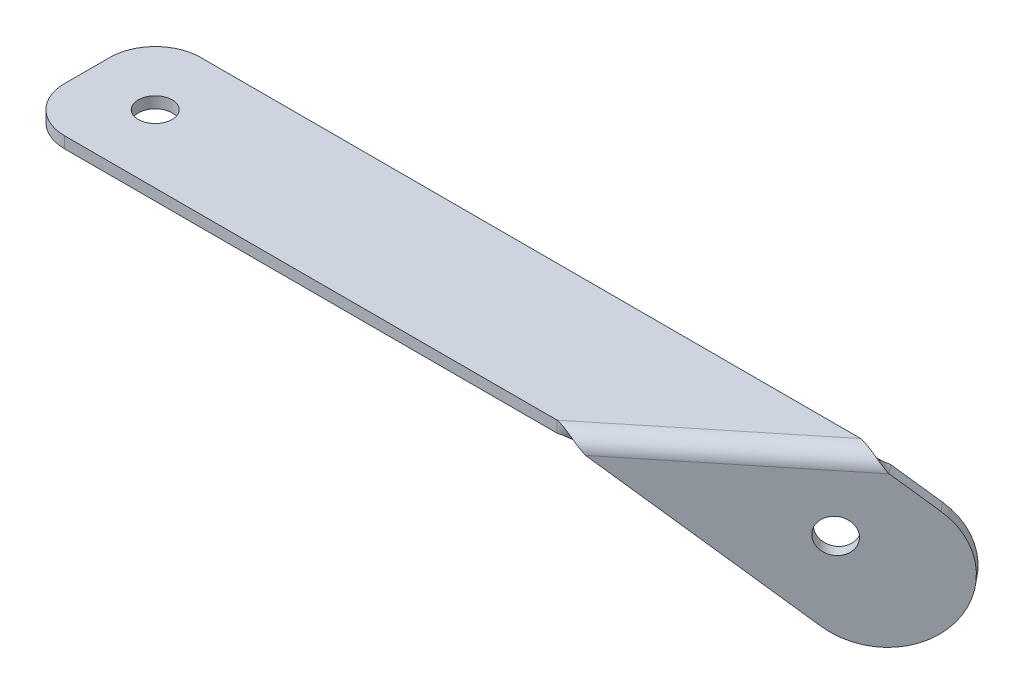
ISO-10303-21;
HEADER;
FILE_DESCRIPTION(('STEP AP214'),'2;1');
FILE_NAME('part.step','',(''),(''),'','','');
FILE_SCHEMA(('AUTOMOTIVE_DESIGN { 1 0 10303 214 1 1 1 1 }'));
ENDSEC;
DATA;
#1=APPLICATION_CONTEXT('core data for automotive mechanical design processes');
#2=APPLICATION_PROTOCOL_DEFINITION('international standard','automotive_design',2000,#1);
#3=PRODUCT_CONTEXT('',#1,'mechanical');
#4=PRODUCT('Part','Part','',(#3));
#5=PRODUCT_RELATED_PRODUCT_CATEGORY('part','',(#4));
#6=PRODUCT_DEFINITION_FORMATION('','',#4);
#7=PRODUCT_DEFINITION_CONTEXT('part definition',#1,'design');
#8=PRODUCT_DEFINITION('design','',#6,#7);
#9=PRODUCT_DEFINITION_SHAPE('','',#8);
#10=(LENGTH_UNIT() NAMED_UNIT(*) SI_UNIT(.MILLI.,.METRE.));
#11=(NAMED_UNIT(*) PLANE_ANGLE_UNIT() SI_UNIT($,.RADIAN.));
#12=(NAMED_UNIT(*) SI_UNIT($,.STERADIAN.) SOLID_ANGLE_UNIT());
#13=UNCERTAINTY_MEASURE_WITH_UNIT(LENGTH_MEASURE(1.E-05),#10,'distance_accuracy_value','');
#14=(GEOMETRIC_REPRESENTATION_CONTEXT(3) GLOBAL_UNCERTAINTY_ASSIGNED_CONTEXT((#13)) GLOBAL_UNIT_ASSIGNED_CONTEXT((#10,
#11,#12)) REPRESENTATION_CONTEXT('',''));
#15=CARTESIAN_POINT('',(0.,0.,0.));
#16=DIRECTION('',(0.,0.,1.));
#17=DIRECTION('',(1.,0.,0.));
#18=AXIS2_PLACEMENT_3D('',#15,#16,#17);
#19=CARTESIAN_POINT('',(6.21928406697261,10.4514248568158,7.67771618663811));
#20=DIRECTION('',(0.629442150170523,0.,0.777047347070118));
#21=DIRECTION('',(-0.489106352924118,-0.777047347070118,0.39619742041129));
#22=AXIS2_PLACEMENT_3D('',#19,#20,#21);
#23=PLANE('',#22);
#24=CARTESIAN_POINT('',(21.5209467758515,-5.49999999999997,-4.717296180339));
#25=DIRECTION('',(0.629442150170523,0.,0.777047347070118));
#26=DIRECTION('',(0.777047347070118,0.,-0.629442150170523));
#27=AXIS2_PLACEMENT_3D('',#24,#25,#26);
#28=CIRCLE('',#27,1.5);
#29=CARTESIAN_POINT('',(22.6865177964566,-5.49999999999997,-5.66145940559478));
#30=VERTEX_POINT('',#29);
#31=EDGE_CURVE('E443',#30,#30,#28,.T.);
#32=ORIENTED_EDGE('',*,*,#31,.T.);
#33=EDGE_LOOP('',(#32));
#34=FACE_BOUND('',#33,.T.);
#35=CARTESIAN_POINT('',(23.7295588750451,-7.80239749812936,-6.50636804816129));
#36=DIRECTION('',(0.629442150170523,0.,0.777047347070118));
#37=DIRECTION('',(0.777047347070118,0.,-0.629442150170523));
#38=AXIS2_PLACEMENT_3D('',#35,#36,#37);
#39=CIRCLE('',#38,6.);
#40=CARTESIAN_POINT('',(26.6641969925898,-3.14011341570864,-8.88355257062904));
#41=VERTEX_POINT('',#40);
#42=CARTESIAN_POINT('',(27.3523743525774,-11.5790503991525,-9.441006165706));
#43=VERTEX_POINT('',#42);
#44=EDGE_CURVE('E235',#41,#43,#39,.F.);
#45=ORIENTED_EDGE('',*,*,#44,.T.);
#46=CARTESIAN_POINT('',(23.7295588750451,-7.80239749812936,-6.5063680481613));
#47=DIRECTION('',(0.629442150170523,0.,0.777047347070118));
#48=DIRECTION('',(0.777047347070118,0.,-0.629442150170523));
#49=AXIS2_PLACEMENT_3D('',#46,#47,#48);
#50=CIRCLE('',#49,6.);
#51=CARTESIAN_POINT('',(20.7949207575004,-12.4646815805501,-4.12918352569356));
#52=VERTEX_POINT('',#51);
#53=EDGE_CURVE('E301',#43,#52,#50,.F.);
#54=ORIENTED_EDGE('',*,*,#53,.T.);
#55=DIRECTION('',(0.603802579588707,-0.629442150170523,-0.489106352924118));
#56=VECTOR('',#55,1.);
#57=CARTESIAN_POINT('',(3.2846459494279,5.78914077439512,10.0549007091059));
#58=LINE('',#57,#56);
#59=CARTESIAN_POINT('',(9.31760612209434,-0.500000000000007,5.16794055501159));
#60=VERTEX_POINT('',#59);
#61=EDGE_CURVE('E228',#60,#52,#58,.T.);
#62=ORIENTED_EDGE('',*,*,#61,.F.);
#63=DIRECTION('',(0.777047347070118,0.,-0.629442150170523));
#64=VECTOR('',#63,1.);
#65=CARTESIAN_POINT('',(6.21928406697259,-0.500000000000009,7.67771618663808));
#66=LINE('',#65,#64);
#67=CARTESIAN_POINT('',(24.1316254284202,-0.499999999999997,-6.8320594449884));
#68=VERTEX_POINT('',#67);
#69=EDGE_CURVE('E280',#60,#68,#66,.T.);
#70=ORIENTED_EDGE('',*,*,#69,.T.);
#71=DIRECTION('',(0.603802579588707,-0.629442150170523,-0.489106352924118));
#72=VECTOR('',#71,1.);
#73=CARTESIAN_POINT('',(9.15392218451732,15.1137089392365,5.30053166417038));
#74=LINE('',#73,#72);
#75=EDGE_CURVE('E236',#41,#68,#74,.F.);
#76=ORIENTED_EDGE('',*,*,#75,.F.);
#77=EDGE_LOOP('',(#45,#54,#62,#70,#76));
#78=FACE_BOUND('',#77,.T.);
#79=ADVANCED_FACE('F57',(#34,#78),#23,.F.);
#80=CARTESIAN_POINT('',(-20.2380150839499,30.966826781216,30.3962021731407));
#81=DIRECTION('',(-0.489106352924118,-0.777047347070118,0.39619742041129));
#82=DIRECTION('',(0.603802579588707,-0.629442150170523,-0.489106352924118));
#83=AXIS2_PLACEMENT_3D('',#80,#81,#82);
#84=PLANE('',#83);
#85=ORIENTED_EDGE('',*,*,#61,.T.);
#86=DIRECTION('',(0.629442150170523,0.,0.777047347070118));
#87=VECTOR('',#86,1.);
#88=CARTESIAN_POINT('',(21.4243629076709,-12.4646815805501,-3.35213617862345));
#89=LINE('',#88,#87);
#90=CARTESIAN_POINT('',(21.4243629076709,-12.4646815805501,-3.35213617862345));
#91=VERTEX_POINT('',#90);
#92=EDGE_CURVE('E229',#52,#91,#89,.T.);
#93=ORIENTED_EDGE('',*,*,#92,.T.);
#94=DIRECTION('',(0.603802579588707,-0.629442150170523,-0.489106352924118));
#95=VECTOR('',#94,1.);
#96=CARTESIAN_POINT('',(-20.2380150839499,30.966826781216,30.3962021731407));
#97=LINE('',#96,#95);
#98=CARTESIAN_POINT('',(9.94704827226488,-0.500000000000016,5.9449879020817));
#99=VERTEX_POINT('',#98);
#100=EDGE_CURVE('E227',#99,#91,#97,.T.);
#101=ORIENTED_EDGE('',*,*,#100,.F.);
#102=CARTESIAN_POINT('',(9.31760612209435,-0.500000000000014,5.16794055501158));
#103=CARTESIAN_POINT('',(9.94704827226487,-0.500000000000043,5.9449879020817));
#104=B_SPLINE_CURVE_WITH_KNOTS('',1,(#102,#103),.UNSPECIFIED.,.F.,.F.,(2,2),(0.,1.),.UNSPECIFIED.);
#105=EDGE_CURVE('E288',#60,#99,#104,.T.);
#106=ORIENTED_EDGE('',*,*,#105,.F.);
#107=EDGE_LOOP('',(#85,#93,#101,#106));
#108=FACE_BOUND('',#107,.T.);
#109=ADVANCED_FACE('F263',(#108),#84,.T.);
#110=CARTESIAN_POINT('',(-14.3687388488604,40.2913949460575,25.6418331282052));
#111=DIRECTION('',(0.489106352924118,0.777047347070118,-0.39619742041129));
#112=DIRECTION('',(-0.603802579588707,0.629442150170523,0.489106352924118));
#113=AXIS2_PLACEMENT_3D('',#110,#111,#112);
#114=PLANE('',#113);
#115=DIRECTION('',(-0.603802579588707,0.629442150170523,0.489106352924118));
#116=VECTOR('',#115,1.);
#117=CARTESIAN_POINT('',(-14.3687388488604,40.2913949460575,25.6418331282052));
#118=LINE('',#117,#116);
#119=CARTESIAN_POINT('',(27.2936391427604,-3.14011341570865,-8.10650522355892));
#120=VERTEX_POINT('',#119);
#121=CARTESIAN_POINT('',(24.7610675785908,-0.50000000000003,-6.0550120979183));
#122=VERTEX_POINT('',#121);
#123=EDGE_CURVE('E224',#120,#122,#118,.T.);
#124=ORIENTED_EDGE('',*,*,#123,.F.);
#125=DIRECTION('',(0.629442150170523,0.,0.777047347070118));
#126=VECTOR('',#125,1.);
#127=CARTESIAN_POINT('',(27.2936391427603,-3.14011341570865,-8.10650522355891));
#128=LINE('',#127,#126);
#129=EDGE_CURVE('E435',#120,#41,#128,.F.);
#130=ORIENTED_EDGE('',*,*,#129,.T.);
#131=ORIENTED_EDGE('',*,*,#75,.T.);
#132=CARTESIAN_POINT('',(24.7610675785908,-0.50000000000003,-6.0550120979183));
#133=CARTESIAN_POINT('',(24.1316254284202,-0.50000000000001,-6.83205944498842));
#134=B_SPLINE_CURVE_WITH_KNOTS('',1,(#132,#133),.UNSPECIFIED.,.F.,.F.,(2,2),(0.,1.),.UNSPECIFIED.);
#135=EDGE_CURVE('E248',#122,#68,#134,.T.);
#136=ORIENTED_EDGE('',*,*,#135,.F.);
#137=EDGE_LOOP('',(#124,#130,#131,#136));
#138=FACE_BOUND('',#137,.T.);
#139=ADVANCED_FACE('F252',(#138),#114,.T.);
#140=CARTESIAN_POINT('',(6.84872621714313,10.4514248568158,8.45476353370823));
#141=DIRECTION('',(0.629442150170523,0.,0.777047347070118));
#142=DIRECTION('',(-0.489106352924118,-0.777047347070118,0.39619742041129));
#143=AXIS2_PLACEMENT_3D('',#140,#141,#142);
#144=PLANE('',#143);
#145=CARTESIAN_POINT('',(22.150388926022,-5.49999999999997,-3.94024883326888));
#146=DIRECTION('',(0.629442150170523,0.,0.777047347070118));
#147=DIRECTION('',(0.777047347070118,0.,-0.629442150170523));
#148=AXIS2_PLACEMENT_3D('',#145,#146,#147);
#149=CIRCLE('',#148,1.5);
#150=CARTESIAN_POINT('',(23.3159599466272,-5.49999999999997,-4.88441205852466));
#151=VERTEX_POINT('',#150);
#152=EDGE_CURVE('E440',#151,#151,#149,.T.);
#153=ORIENTED_EDGE('',*,*,#152,.F.);
#154=EDGE_LOOP('',(#153));
#155=FACE_BOUND('',#154,.T.);
#156=ORIENTED_EDGE('',*,*,#100,.T.);
#157=CARTESIAN_POINT('',(24.3590010252156,-7.80239749812936,-5.72932070109118));
#158=DIRECTION('',(0.629442150170523,0.,0.777047347070118));
#159=DIRECTION('',(0.777047347070118,0.,-0.629442150170523));
#160=AXIS2_PLACEMENT_3D('',#157,#158,#159);
#161=CIRCLE('',#160,6.);
#162=CARTESIAN_POINT('',(27.9818165027479,-11.5790503991525,-8.66395881863588));
#163=VERTEX_POINT('',#162);
#164=EDGE_CURVE('E233',#91,#163,#161,.T.);
#165=ORIENTED_EDGE('',*,*,#164,.T.);
#166=CARTESIAN_POINT('',(24.3590010252156,-7.80239749812936,-5.72932070109118));
#167=DIRECTION('',(0.629442150170523,0.,0.777047347070118));
#168=DIRECTION('',(0.777047347070118,0.,-0.629442150170523));
#169=AXIS2_PLACEMENT_3D('',#166,#167,#168);
#170=CIRCLE('',#169,6.);
#171=EDGE_CURVE('E231',#163,#120,#170,.T.);
#172=ORIENTED_EDGE('',*,*,#171,.T.);
#173=ORIENTED_EDGE('',*,*,#123,.T.);
#174=DIRECTION('',(0.777047347070118,0.,-0.629442150170523));
#175=VECTOR('',#174,1.);
#176=CARTESIAN_POINT('',(6.84872621714311,-0.500000000000013,8.4547635337082));
#177=LINE('',#176,#175);
#178=EDGE_CURVE('E168',#99,#122,#177,.T.);
#179=ORIENTED_EDGE('',*,*,#178,.F.);
#180=EDGE_LOOP('',(#156,#165,#172,#173,#179));
#181=FACE_BOUND('',#180,.T.);
#182=ADVANCED_FACE('F262',(#155,#181),#144,.T.);
#183=CARTESIAN_POINT('',(-40.,1.,-6.));
#184=DIRECTION('',(-1.,0.,0.));
#185=DIRECTION('',(0.,0.,1.));
#186=AXIS2_PLACEMENT_3D('',#183,#184,#185);
#187=PLANE('',#186);
#188=DIRECTION('',(0.,0.,1.));
#189=VECTOR('',#188,1.);
#190=CARTESIAN_POINT('',(-40.,1.,-6.));
#191=LINE('',#190,#189);
#192=CARTESIAN_POINT('',(-40.,1.,-2.));
#193=VERTEX_POINT('',#192);
#194=CARTESIAN_POINT('',(-40.,1.,2.));
#195=VERTEX_POINT('',#194);
#196=EDGE_CURVE('E156',#193,#195,#191,.T.);
#197=ORIENTED_EDGE('',*,*,#196,.F.);
#198=DIRECTION('',(0.,1.,0.));
#199=VECTOR('',#198,1.);
#200=CARTESIAN_POINT('',(-40.,1.,-2.));
#201=LINE('',#200,#199);
#202=CARTESIAN_POINT('',(-40.,0.,-2.));
#203=VERTEX_POINT('',#202);
#204=EDGE_CURVE('E208',#193,#203,#201,.F.);
#205=ORIENTED_EDGE('',*,*,#204,.T.);
#206=DIRECTION('',(0.,0.,1.));
#207=VECTOR('',#206,1.);
#208=CARTESIAN_POINT('',(-40.,0.,0.));
#209=LINE('',#208,#207);
#210=CARTESIAN_POINT('',(-40.,0.,2.));
#211=VERTEX_POINT('',#210);
#212=EDGE_CURVE('E399',#203,#211,#209,.T.);
#213=ORIENTED_EDGE('',*,*,#212,.T.);
#214=DIRECTION('',(0.,1.,0.));
#215=VECTOR('',#214,1.);
#216=CARTESIAN_POINT('',(-40.,1.,2.));
#217=LINE('',#216,#215);
#218=EDGE_CURVE('E205',#211,#195,#217,.T.);
#219=ORIENTED_EDGE('',*,*,#218,.T.);
#220=EDGE_LOOP('',(#197,#205,#213,#219));
#221=FACE_BOUND('',#220,.T.);
#222=ADVANCED_FACE('F366',(#221),#187,.T.);
#223=CARTESIAN_POINT('',(-34.,1.,0.));
#224=DIRECTION('',(0.,1.,0.));
#225=DIRECTION('',(0.,0.,1.));
#226=AXIS2_PLACEMENT_3D('',#223,#224,#225);
#227=CYLINDRICAL_SURFACE('',#226,1.5);
#228=CARTESIAN_POINT('',(-34.,1.,0.));
#229=DIRECTION('',(0.,1.,0.));
#230=DIRECTION('',(0.,0.,1.));
#231=AXIS2_PLACEMENT_3D('',#228,#229,#230);
#232=CIRCLE('',#231,1.5);
#233=CARTESIAN_POINT('',(-34.,1.,1.5));
#234=VERTEX_POINT('',#233);
#235=EDGE_CURVE('E199',#234,#234,#232,.T.);
#236=ORIENTED_EDGE('',*,*,#235,.T.);
#237=EDGE_LOOP('',(#236));
#238=FACE_BOUND('',#237,.T.);
#239=CARTESIAN_POINT('',(-34.,0.,0.));
#240=DIRECTION('',(0.,1.,0.));
#241=DIRECTION('',(0.,0.,1.));
#242=AXIS2_PLACEMENT_3D('',#239,#240,#241);
#243=CIRCLE('',#242,1.5);
#244=CARTESIAN_POINT('',(-34.,0.,1.5));
#245=VERTEX_POINT('',#244);
#246=EDGE_CURVE('E214',#245,#245,#243,.T.);
#247=ORIENTED_EDGE('',*,*,#246,.F.);
#248=EDGE_LOOP('',(#247));
#249=FACE_BOUND('',#248,.T.);
#250=ADVANCED_FACE('F498',(#238,#249),#227,.F.);
#251=CARTESIAN_POINT('',(0.,1.,0.));
#252=DIRECTION('',(0.,1.,0.));
#253=DIRECTION('',(0.,0.,1.));
#254=AXIS2_PLACEMENT_3D('',#251,#252,#253);
#255=PLANE('',#254);
#256=ORIENTED_EDGE('',*,*,#235,.F.);
#257=EDGE_LOOP('',(#256));
#258=FACE_BOUND('',#257,.T.);
#259=DIRECTION('',(-1.,0.,0.));
#260=VECTOR('',#259,1.);
#261=CARTESIAN_POINT('',(-40.,1.,-6.));
#262=LINE('',#261,#260);
#263=CARTESIAN_POINT('',(22.3100925297698,1.,-5.99999999999999));
#264=VERTEX_POINT('',#263);
#265=CARTESIAN_POINT('',(-36.,1.,-6.));
#266=VERTEX_POINT('',#265);
#267=EDGE_CURVE('E177',#264,#266,#262,.T.);
#268=ORIENTED_EDGE('',*,*,#267,.T.);
#269=CARTESIAN_POINT('',(-36.,1.,-2.));
#270=DIRECTION('',(0.,1.,0.));
#271=DIRECTION('',(0.,0.,1.));
#272=AXIS2_PLACEMENT_3D('',#269,#270,#271);
#273=CIRCLE('',#272,4.);
#274=EDGE_CURVE('E203',#266,#193,#273,.T.);
#275=ORIENTED_EDGE('',*,*,#274,.T.);
#276=ORIENTED_EDGE('',*,*,#196,.T.);
#277=CARTESIAN_POINT('',(-36.,1.,2.));
#278=DIRECTION('',(0.,1.,0.));
#279=DIRECTION('',(0.,0.,1.));
#280=AXIS2_PLACEMENT_3D('',#277,#278,#279);
#281=CIRCLE('',#280,4.);
#282=CARTESIAN_POINT('',(-36.,1.,6.));
#283=VERTEX_POINT('',#282);
#284=EDGE_CURVE('E201',#195,#283,#281,.T.);
#285=ORIENTED_EDGE('',*,*,#284,.T.);
#286=DIRECTION('',(1.,0.,0.));
#287=VECTOR('',#286,1.);
#288=CARTESIAN_POINT('',(-40.,1.,6.));
#289=LINE('',#288,#287);
#290=CARTESIAN_POINT('',(7.49607322344389,1.,6.));
#291=VERTEX_POINT('',#290);
#292=EDGE_CURVE('E178',#283,#291,#289,.T.);
#293=ORIENTED_EDGE('',*,*,#292,.T.);
#294=DIRECTION('',(0.777047347070118,0.,-0.629442150170523));
#295=VECTOR('',#294,1.);
#296=CARTESIAN_POINT('',(5.90456299188732,1.,7.28919251310302));
#297=LINE('',#296,#295);
#298=EDGE_CURVE('E166',#291,#264,#297,.T.);
#299=ORIENTED_EDGE('',*,*,#298,.T.);
#300=EDGE_LOOP('',(#268,#275,#276,#285,#293,#299));
#301=FACE_BOUND('',#300,.T.);
#302=ADVANCED_FACE('F176',(#258,#301),#255,.T.);
#303=CARTESIAN_POINT('',(-40.,1.,-6.));
#304=DIRECTION('',(0.,0.,-1.));
#305=DIRECTION('',(-1.,0.,0.));
#306=AXIS2_PLACEMENT_3D('',#303,#304,#305);
#307=PLANE('',#306);
#308=DIRECTION('',(1.,0.,0.));
#309=VECTOR('',#308,1.);
#310=CARTESIAN_POINT('',(0.,0.,-6.));
#311=LINE('',#310,#309);
#312=CARTESIAN_POINT('',(22.3100925297698,0.,-6.));
#313=VERTEX_POINT('',#312);
#314=CARTESIAN_POINT('',(-36.,0.,-6.));
#315=VERTEX_POINT('',#314);
#316=EDGE_CURVE('E155',#313,#315,#311,.F.);
#317=ORIENTED_EDGE('',*,*,#316,.T.);
#318=DIRECTION('',(0.,1.,0.));
#319=VECTOR('',#318,1.);
#320=CARTESIAN_POINT('',(-36.,1.,-6.));
#321=LINE('',#320,#319);
#322=EDGE_CURVE('E183',#315,#266,#321,.T.);
#323=ORIENTED_EDGE('',*,*,#322,.T.);
#324=ORIENTED_EDGE('',*,*,#267,.F.);
#325=CARTESIAN_POINT('',(22.3100925297698,0.,-6.));
#326=CARTESIAN_POINT('',(22.3100925297698,1.,-6.));
#327=B_SPLINE_CURVE_WITH_KNOTS('',1,(#325,#326),.UNSPECIFIED.,.F.,.F.,(2,2),(0.,1.),.UNSPECIFIED.);
#328=EDGE_CURVE('E140',#264,#313,#327,.F.);
#329=ORIENTED_EDGE('',*,*,#328,.T.);
#330=EDGE_LOOP('',(#317,#323,#324,#329));
#331=FACE_BOUND('',#330,.T.);
#332=ADVANCED_FACE('F181',(#331),#307,.T.);
#333=CARTESIAN_POINT('',(0.,0.,0.));
#334=DIRECTION('',(0.,1.,0.));
#335=DIRECTION('',(0.,0.,1.));
#336=AXIS2_PLACEMENT_3D('',#333,#334,#335);
#337=PLANE('',#336);
#338=ORIENTED_EDGE('',*,*,#212,.F.);
#339=CARTESIAN_POINT('',(-36.,0.,-2.));
#340=DIRECTION('',(0.,1.,0.));
#341=DIRECTION('',(0.,0.,1.));
#342=AXIS2_PLACEMENT_3D('',#339,#340,#341);
#343=CIRCLE('',#342,4.);
#344=EDGE_CURVE('E65',#203,#315,#343,.F.);
#345=ORIENTED_EDGE('',*,*,#344,.T.);
#346=ORIENTED_EDGE('',*,*,#316,.F.);
#347=DIRECTION('',(0.777047347070118,0.,-0.629442150170523));
#348=VECTOR('',#347,1.);
#349=CARTESIAN_POINT('',(5.90456299188732,0.,7.28919251310302));
#350=LINE('',#349,#348);
#351=CARTESIAN_POINT('',(7.49607322344389,0.,6.));
#352=VERTEX_POINT('',#351);
#353=EDGE_CURVE('E170',#352,#313,#350,.T.);
#354=ORIENTED_EDGE('',*,*,#353,.F.);
#355=DIRECTION('',(1.,0.,0.));
#356=VECTOR('',#355,1.);
#357=CARTESIAN_POINT('',(0.,0.,6.));
#358=LINE('',#357,#356);
#359=CARTESIAN_POINT('',(-36.,0.,6.));
#360=VERTEX_POINT('',#359);
#361=EDGE_CURVE('E210',#360,#352,#358,.T.);
#362=ORIENTED_EDGE('',*,*,#361,.F.);
#363=CARTESIAN_POINT('',(-36.,0.,2.));
#364=DIRECTION('',(0.,1.,0.));
#365=DIRECTION('',(0.,0.,1.));
#366=AXIS2_PLACEMENT_3D('',#363,#364,#365);
#367=CIRCLE('',#366,4.);
#368=EDGE_CURVE('E77',#360,#211,#367,.F.);
#369=ORIENTED_EDGE('',*,*,#368,.T.);
#370=EDGE_LOOP('',(#338,#345,#346,#354,#362,#369));
#371=FACE_BOUND('',#370,.T.);
#372=ORIENTED_EDGE('',*,*,#246,.T.);
#373=EDGE_LOOP('',(#372));
#374=FACE_BOUND('',#373,.T.);
#375=ADVANCED_FACE('F419',(#371,#374),#337,.F.);
#376=CARTESIAN_POINT('',(-40.,1.,6.));
#377=DIRECTION('',(0.,0.,1.));
#378=DIRECTION('',(1.,0.,0.));
#379=AXIS2_PLACEMENT_3D('',#376,#377,#378);
#380=PLANE('',#379);
#381=ORIENTED_EDGE('',*,*,#292,.F.);
#382=DIRECTION('',(0.,1.,0.));
#383=VECTOR('',#382,1.);
#384=CARTESIAN_POINT('',(-36.,1.,6.));
#385=LINE('',#384,#383);
#386=EDGE_CURVE('E12',#283,#360,#385,.F.);
#387=ORIENTED_EDGE('',*,*,#386,.T.);
#388=ORIENTED_EDGE('',*,*,#361,.T.);
#389=CARTESIAN_POINT('',(7.49607322344389,1.,6.));
#390=CARTESIAN_POINT('',(7.49607322344389,0.,6.));
#391=B_SPLINE_CURVE_WITH_KNOTS('',1,(#389,#390),.UNSPECIFIED.,.F.,.F.,(2,2),(0.,1.),.UNSPECIFIED.);
#392=EDGE_CURVE('E213',#352,#291,#391,.F.);
#393=ORIENTED_EDGE('',*,*,#392,.T.);
#394=EDGE_LOOP('',(#381,#387,#388,#393));
#395=FACE_BOUND('',#394,.T.);
#396=ADVANCED_FACE('F421',(#395),#380,.T.);
#397=CARTESIAN_POINT('',(7.49607322344389,1.,6.));
#398=CARTESIAN_POINT('',(7.74525833476119,1.,6.05086309665523));
#399=CARTESIAN_POINT('',(7.99434125407196,0.960959015002472,6.10165522895999));
#400=CARTESIAN_POINT('',(8.47384235210598,0.810679582531381,6.18014264943923));
#401=CARTESIAN_POINT('',(8.70414389646461,0.69950026359726,6.20772154822596));
#402=CARTESIAN_POINT('',(9.13006281223904,0.421820079962353,6.22006167849948));
#403=CARTESIAN_POINT('',(9.32561141376719,0.255428470556325,6.20473801344934));
#404=CARTESIAN_POINT('',(9.67133892679573,-0.107378173461114,6.11808172801629));
#405=CARTESIAN_POINT('',(9.82146712295986,-0.303629353422282,6.04671409539216));
#406=CARTESIAN_POINT('',(9.94704827226487,-0.500000000000043,5.9449879020817));
#407=CARTESIAN_POINT('',(7.49607322344389,0.,6.));
#408=CARTESIAN_POINT('',(7.66284200501697,0.,5.94914107785154));
#409=CARTESIAN_POINT('',(7.82958610293827,-0.0130136616658422,5.89826472981739));
#410=CARTESIAN_POINT('',(8.15684333823463,-0.0631068058228729,5.78880685680786));
#411=CARTESIAN_POINT('',(8.31732228766336,-0.100166578800913,5.7301896498188));
#412=CARTESIAN_POINT('',(8.62671879553985,-0.192726640012549,5.59868268007403));
#413=CARTESIAN_POINT('',(8.77561343069175,-0.248190509814558,5.52576461847268));
#414=CARTESIAN_POINT('',(9.05827947098628,-0.369126057820371,5.36125884349238));
#415=CARTESIAN_POINT('',(9.19203527965997,-0.434548490075644,5.26965839930851));
#416=CARTESIAN_POINT('',(9.31760612209435,-0.500000000000014,5.16794055501158));
#417=B_SPLINE_SURFACE_WITH_KNOTS('',1,3,((#397,#398,#399,#400,#401,#402,#403,#404,#405,#406),
(#407,#408,#409,#410,#411,#412,#413,#414,#415,#416)),.UNSPECIFIED.,.F.,.F.,.F.,(2,2),(4,2,2,2,
4),(0.,1.),(0.,0.25,0.5,0.75,1.),.UNSPECIFIED.);
#418=CARTESIAN_POINT('',(7.49607322344389,0.,6.));
#419=CARTESIAN_POINT('',(7.66284200501697,0.,5.94914107785154));
#420=CARTESIAN_POINT('',(7.82958610293827,-0.0130136616658422,5.89826472981739));
#421=CARTESIAN_POINT('',(8.15684333823463,-0.0631068058228729,5.78880685680786));
#422=CARTESIAN_POINT('',(8.31732228766336,-0.100166578800913,5.7301896498188));
#423=CARTESIAN_POINT('',(8.62671879553985,-0.192726640012549,5.59868268007403));
#424=CARTESIAN_POINT('',(8.77561343069175,-0.248190509814558,5.52576461847268));
#425=CARTESIAN_POINT('',(9.05827947098628,-0.369126057820371,5.36125884349238));
#426=CARTESIAN_POINT('',(9.19203527965997,-0.434548490075644,5.26965839930851));
#427=CARTESIAN_POINT('',(9.31760612209435,-0.500000000000014,5.16794055501158));
#428=B_SPLINE_CURVE_WITH_KNOTS('',3,(#418,#419,#420,#421,#422,#423,#424,#425,#426,#427),
.UNSPECIFIED.,.F.,.F.,(4,2,2,2,4),(0.,0.25,0.5,0.75,1.),.UNSPECIFIED.);
#429=EDGE_CURVE('E309',#352,#60,#428,.T.);
#430=CARTESIAN_POINT('',(9.94704827226487,-0.500000000000043,5.9449879020817));
#431=CARTESIAN_POINT('',(9.82146712295986,-0.303629353422282,6.04671409539216));
#432=CARTESIAN_POINT('',(9.67133892679573,-0.107378173461114,6.11808172801629));
#433=CARTESIAN_POINT('',(9.32561141376719,0.255428470556325,6.20473801344934));
#434=CARTESIAN_POINT('',(9.13006281223904,0.421820079962353,6.22006167849948));
#435=CARTESIAN_POINT('',(8.70414389646461,0.69950026359726,6.20772154822596));
#436=CARTESIAN_POINT('',(8.47384235210598,0.810679582531381,6.18014264943923));
#437=CARTESIAN_POINT('',(7.99434125407196,0.960959015002472,6.10165522895999));
#438=CARTESIAN_POINT('',(7.74525833476119,1.,6.05086309665523));
#439=CARTESIAN_POINT('',(7.49607322344389,1.,6.));
#440=B_SPLINE_CURVE_WITH_KNOTS('',3,(#430,#431,#432,#433,#434,#435,#436,#437,#438,#439),
.UNSPECIFIED.,.F.,.F.,(4,2,2,2,4),(0.,0.25,0.5,0.75,1.),.UNSPECIFIED.);
#441=EDGE_CURVE('E171',#291,#99,#440,.F.);
#442=ORIENTED_EDGE('',*,*,#392,.F.);
#443=ORIENTED_EDGE('',*,*,#429,.T.);
#444=ORIENTED_EDGE('',*,*,#105,.T.);
#445=ORIENTED_EDGE('',*,*,#441,.F.);
#446=EDGE_LOOP('',(#442,#443,#444,#445));
#447=FACE_BOUND('',#446,.T.);
#448=ADVANCED_FACE('F306',(#447),#417,.T.);
#449=CARTESIAN_POINT('',(24.7610675785908,-0.50000000000003,-6.0550120979183));
#450=CARTESIAN_POINT('',(24.6354864292857,-0.303629353422266,-5.95328590460783));
#451=CARTESIAN_POINT('',(24.4853582331216,-0.107378173461104,-5.88191827198371));
#452=CARTESIAN_POINT('',(24.1396307200931,0.255428470556333,-5.79526198655066));
#453=CARTESIAN_POINT('',(23.9440821185649,0.42182007996236,-5.77993832150052));
#454=CARTESIAN_POINT('',(23.5181632027905,0.699500263597264,-5.79227845177405));
#455=CARTESIAN_POINT('',(23.2878616584319,0.810679582531384,-5.81985735056077));
#456=CARTESIAN_POINT('',(22.8083605603979,0.960959015002473,-5.89834477104002));
#457=CARTESIAN_POINT('',(22.5592776410871,1.,-5.94913690334477));
#458=CARTESIAN_POINT('',(22.3100925297698,1.,-6.));
#459=CARTESIAN_POINT('',(24.1316254284202,-0.50000000000001,-6.83205944498842));
#460=CARTESIAN_POINT('',(24.0060545859859,-0.434548490075636,-6.73034160069148));
#461=CARTESIAN_POINT('',(23.8722987773122,-0.369126057820368,-6.63874115650761));
#462=CARTESIAN_POINT('',(23.5896327370176,-0.248190509814556,-6.47423538152732));
#463=CARTESIAN_POINT('',(23.4407381018657,-0.192726640012546,-6.40131731992597));
#464=CARTESIAN_POINT('',(23.1313415939893,-0.100166578800912,-6.26981035018121));
#465=CARTESIAN_POINT('',(22.9708626445605,-0.0631068058228723,-6.21119314319214));
#466=CARTESIAN_POINT('',(22.6436054092642,-0.0130136616658422,-6.10173527018262));
#467=CARTESIAN_POINT('',(22.4768613113429,0.,-6.05085892214846));
#468=CARTESIAN_POINT('',(22.3100925297698,0.,-6.));
#469=B_SPLINE_SURFACE_WITH_KNOTS('',1,3,((#449,#450,#451,#452,#453,#454,#455,#456,#457,#458),
(#459,#460,#461,#462,#463,#464,#465,#466,#467,#468)),.UNSPECIFIED.,.F.,.F.,.F.,(2,2),(4,2,2,2,
4),(0.,1.),(0.,0.25,0.5,0.75,1.),.UNSPECIFIED.);
#470=CARTESIAN_POINT('',(24.1316254284202,-0.50000000000001,-6.83205944498842));
#471=CARTESIAN_POINT('',(24.0060545859859,-0.434548490075636,-6.73034160069148));
#472=CARTESIAN_POINT('',(23.8722987773122,-0.369126057820368,-6.63874115650761));
#473=CARTESIAN_POINT('',(23.5896327370176,-0.248190509814556,-6.47423538152732));
#474=CARTESIAN_POINT('',(23.4407381018657,-0.192726640012546,-6.40131731992597));
#475=CARTESIAN_POINT('',(23.1313415939893,-0.100166578800912,-6.26981035018121));
#476=CARTESIAN_POINT('',(22.9708626445605,-0.0631068058228723,-6.21119314319214));
#477=CARTESIAN_POINT('',(22.6436054092642,-0.0130136616658422,-6.10173527018262));
#478=CARTESIAN_POINT('',(22.4768613113429,0.,-6.05085892214846));
#479=CARTESIAN_POINT('',(22.3100925297698,0.,-6.));
#480=B_SPLINE_CURVE_WITH_KNOTS('',3,(#470,#471,#472,#473,#474,#475,#476,#477,#478,#479),
.UNSPECIFIED.,.F.,.F.,(4,2,2,2,4),(0.,0.25,0.5,0.75,1.),.UNSPECIFIED.);
#481=EDGE_CURVE('E148',#68,#313,#480,.T.);
#482=CARTESIAN_POINT('',(22.3100925297698,1.,-6.));
#483=CARTESIAN_POINT('',(22.5592776410871,1.,-5.94913690334477));
#484=CARTESIAN_POINT('',(22.8083605603979,0.960959015002473,-5.89834477104002));
#485=CARTESIAN_POINT('',(23.2878616584319,0.810679582531384,-5.81985735056077));
#486=CARTESIAN_POINT('',(23.5181632027905,0.699500263597264,-5.79227845177405));
#487=CARTESIAN_POINT('',(23.9440821185649,0.42182007996236,-5.77993832150052));
#488=CARTESIAN_POINT('',(24.1396307200931,0.255428470556333,-5.79526198655066));
#489=CARTESIAN_POINT('',(24.4853582331216,-0.107378173461104,-5.88191827198371));
#490=CARTESIAN_POINT('',(24.6354864292857,-0.303629353422266,-5.95328590460783));
#491=CARTESIAN_POINT('',(24.7610675785908,-0.50000000000003,-6.0550120979183));
#492=B_SPLINE_CURVE_WITH_KNOTS('',3,(#482,#483,#484,#485,#486,#487,#488,#489,#490,#491),
.UNSPECIFIED.,.F.,.F.,(4,2,2,2,4),(0.,0.25,0.5,0.75,1.),.UNSPECIFIED.);
#493=EDGE_CURVE('E145',#122,#264,#492,.F.);
#494=ORIENTED_EDGE('',*,*,#481,.T.);
#495=ORIENTED_EDGE('',*,*,#328,.F.);
#496=ORIENTED_EDGE('',*,*,#493,.F.);
#497=ORIENTED_EDGE('',*,*,#135,.T.);
#498=EDGE_LOOP('',(#494,#495,#496,#497));
#499=FACE_BOUND('',#498,.T.);
#500=ADVANCED_FACE('F143',(#499),#469,.T.);
#501=CARTESIAN_POINT('',(-1.48176239270331,-0.5,13.2724373558607));
#502=DIRECTION('',(0.777047347070118,0.,-0.629442150170523));
#503=DIRECTION('',(-0.629442150170523,0.,-0.777047347070118));
#504=AXIS2_PLACEMENT_3D('',#501,#502,#503);
#505=CYLINDRICAL_SURFACE('',#504,1.5);
#506=ORIENTED_EDGE('',*,*,#178,.T.);
#507=ORIENTED_EDGE('',*,*,#493,.T.);
#508=ORIENTED_EDGE('',*,*,#298,.F.);
#509=ORIENTED_EDGE('',*,*,#441,.T.);
#510=EDGE_LOOP('',(#506,#507,#508,#509));
#511=FACE_BOUND('',#510,.T.);
#512=ADVANCED_FACE('F164',(#511),#505,.T.);
#513=CARTESIAN_POINT('',(-1.48176239270331,-0.5,13.2724373558607));
#514=DIRECTION('',(0.777047347070118,0.,-0.629442150170523));
#515=DIRECTION('',(-0.629442150170523,0.,-0.777047347070118));
#516=AXIS2_PLACEMENT_3D('',#513,#514,#515);
#517=CYLINDRICAL_SURFACE('',#516,0.5);
#518=ORIENTED_EDGE('',*,*,#69,.F.);
#519=ORIENTED_EDGE('',*,*,#429,.F.);
#520=ORIENTED_EDGE('',*,*,#353,.T.);
#521=ORIENTED_EDGE('',*,*,#481,.F.);
#522=EDGE_LOOP('',(#518,#519,#520,#521));
#523=FACE_BOUND('',#522,.T.);
#524=ADVANCED_FACE('F328',(#523),#517,.F.);
#525=CARTESIAN_POINT('',(21.5209467758515,-5.49999999999997,-4.717296180339));
#526=DIRECTION('',(0.629442150170523,0.,0.777047347070118));
#527=DIRECTION('',(0.777047347070118,0.,-0.629442150170523));
#528=AXIS2_PLACEMENT_3D('',#525,#526,#527);
#529=CYLINDRICAL_SURFACE('',#528,1.5);
#530=ORIENTED_EDGE('',*,*,#31,.F.);
#531=EDGE_LOOP('',(#530));
#532=FACE_BOUND('',#531,.T.);
#533=ORIENTED_EDGE('',*,*,#152,.T.);
#534=EDGE_LOOP('',(#533));
#535=FACE_BOUND('',#534,.T.);
#536=ADVANCED_FACE('F337',(#532,#535),#529,.F.);
#537=CARTESIAN_POINT('',(24.3590010252156,-7.80239749812936,-5.72932070109117));
#538=DIRECTION('',(0.629442150170523,0.,0.777047347070118));
#539=DIRECTION('',(0.777047347070118,0.,-0.629442150170523));
#540=AXIS2_PLACEMENT_3D('',#537,#538,#539);
#541=CYLINDRICAL_SURFACE('',#540,6.);
#542=DIRECTION('',(0.629442150170523,0.,0.777047347070118));
#543=VECTOR('',#542,1.);
#544=CARTESIAN_POINT('',(27.9818165027479,-11.5790503991525,-8.66395881863588));
#545=LINE('',#544,#543);
#546=EDGE_CURVE('E439',#43,#163,#545,.T.);
#547=ORIENTED_EDGE('',*,*,#546,.F.);
#548=ORIENTED_EDGE('',*,*,#44,.F.);
#549=ORIENTED_EDGE('',*,*,#129,.F.);
#550=ORIENTED_EDGE('',*,*,#171,.F.);
#551=EDGE_LOOP('',(#547,#548,#549,#550));
#552=FACE_BOUND('',#551,.T.);
#553=ADVANCED_FACE('F451',(#552),#541,.T.);
#554=CARTESIAN_POINT('',(24.3590010252156,-7.80239749812936,-5.72932070109118));
#555=DIRECTION('',(0.629442150170523,0.,0.777047347070118));
#556=DIRECTION('',(0.777047347070118,0.,-0.629442150170523));
#557=AXIS2_PLACEMENT_3D('',#554,#555,#556);
#558=CYLINDRICAL_SURFACE('',#557,6.);
#559=ORIENTED_EDGE('',*,*,#53,.F.);
#560=ORIENTED_EDGE('',*,*,#546,.T.);
#561=ORIENTED_EDGE('',*,*,#164,.F.);
#562=ORIENTED_EDGE('',*,*,#92,.F.);
#563=EDGE_LOOP('',(#559,#560,#561,#562));
#564=FACE_BOUND('',#563,.T.);
#565=ADVANCED_FACE('F271',(#564),#558,.T.);
#566=CARTESIAN_POINT('',(-36.,1.,-2.));
#567=DIRECTION('',(0.,1.,0.));
#568=DIRECTION('',(0.,0.,1.));
#569=AXIS2_PLACEMENT_3D('',#566,#567,#568);
#570=CYLINDRICAL_SURFACE('',#569,4.);
#571=ORIENTED_EDGE('',*,*,#344,.F.);
#572=ORIENTED_EDGE('',*,*,#204,.F.);
#573=ORIENTED_EDGE('',*,*,#274,.F.);
#574=ORIENTED_EDGE('',*,*,#322,.F.);
#575=EDGE_LOOP('',(#571,#572,#573,#574));
#576=FACE_BOUND('',#575,.T.);
#577=ADVANCED_FACE('F434',(#576),#570,.T.);
#578=CARTESIAN_POINT('',(-36.,1.,2.));
#579=DIRECTION('',(0.,1.,0.));
#580=DIRECTION('',(0.,0.,1.));
#581=AXIS2_PLACEMENT_3D('',#578,#579,#580);
#582=CYLINDRICAL_SURFACE('',#581,4.);
#583=ORIENTED_EDGE('',*,*,#368,.F.);
#584=ORIENTED_EDGE('',*,*,#386,.F.);
#585=ORIENTED_EDGE('',*,*,#284,.F.);
#586=ORIENTED_EDGE('',*,*,#218,.F.);
#587=EDGE_LOOP('',(#583,#584,#585,#586));
#588=FACE_BOUND('',#587,.T.);
#589=ADVANCED_FACE('F59',(#588),#582,.T.);
#590=CLOSED_SHELL('',(#79,#109,#139,#182,#222,#250,#302,#332,#375,#396,#448,#500,#512,#524,#536,
#553,#565,#577,#589));
#591=MANIFOLD_SOLID_BREP('B2',#590);
#592=ADVANCED_BREP_SHAPE_REPRESENTATION('',(#18,#591),#14);
#593=SHAPE_DEFINITION_REPRESENTATION(#9,#592);
ENDSEC;
END-ISO-10303-21;
